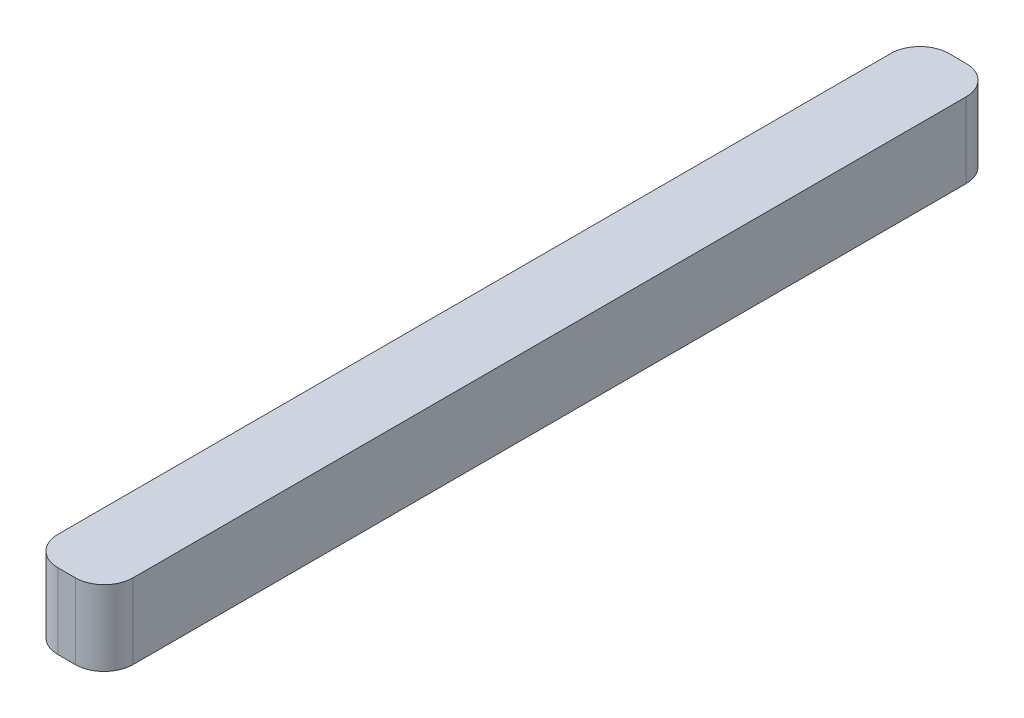
ISO-10303-21;
HEADER;
FILE_DESCRIPTION(('STEP AP214'),'2;1');
FILE_NAME('part.step','',(''),(''),'','','');
FILE_SCHEMA(('AUTOMOTIVE_DESIGN { 1 0 10303 214 1 1 1 1 }'));
ENDSEC;
DATA;
#1=APPLICATION_CONTEXT('core data for automotive mechanical design processes');
#2=APPLICATION_PROTOCOL_DEFINITION('international standard','automotive_design',2000,#1);
#3=PRODUCT_CONTEXT('',#1,'mechanical');
#4=PRODUCT('Part','Part','',(#3));
#5=PRODUCT_RELATED_PRODUCT_CATEGORY('part','',(#4));
#6=PRODUCT_DEFINITION_FORMATION('','',#4);
#7=PRODUCT_DEFINITION_CONTEXT('part definition',#1,'design');
#8=PRODUCT_DEFINITION('design','',#6,#7);
#9=PRODUCT_DEFINITION_SHAPE('','',#8);
#10=(LENGTH_UNIT() NAMED_UNIT(*) SI_UNIT(.MILLI.,.METRE.));
#11=(NAMED_UNIT(*) PLANE_ANGLE_UNIT() SI_UNIT($,.RADIAN.));
#12=(NAMED_UNIT(*) SI_UNIT($,.STERADIAN.) SOLID_ANGLE_UNIT());
#13=UNCERTAINTY_MEASURE_WITH_UNIT(LENGTH_MEASURE(1.E-05),#10,'distance_accuracy_value','');
#14=(GEOMETRIC_REPRESENTATION_CONTEXT(3) GLOBAL_UNCERTAINTY_ASSIGNED_CONTEXT((#13)) GLOBAL_UNIT_ASSIGNED_CONTEXT((#10,
#11,#12)) REPRESENTATION_CONTEXT('',''));
#15=CARTESIAN_POINT('',(0.,0.,0.));
#16=DIRECTION('',(0.,0.,1.));
#17=DIRECTION('',(1.,0.,0.));
#18=AXIS2_PLACEMENT_3D('',#15,#16,#17);
#19=CARTESIAN_POINT('',(8.8,2.6,-6.8));
#20=DIRECTION('',(0.,-1.,0.));
#21=DIRECTION('',(0.,0.,-1.));
#22=AXIS2_PLACEMENT_3D('',#19,#20,#21);
#23=CYLINDRICAL_SURFACE('',#22,1.);
#24=CARTESIAN_POINT('',(8.8,0.,-6.8));
#25=DIRECTION('',(0.,-1.,0.));
#26=DIRECTION('',(0.,0.,-1.));
#27=AXIS2_PLACEMENT_3D('',#24,#25,#26);
#28=CIRCLE('',#27,1.);
#29=CARTESIAN_POINT('',(8.8,0.,-7.8));
#30=VERTEX_POINT('',#29);
#31=CARTESIAN_POINT('',(7.8,0.,-6.8));
#32=VERTEX_POINT('',#31);
#33=EDGE_CURVE('E122',#30,#32,#28,.F.);
#34=ORIENTED_EDGE('',*,*,#33,.T.);
#35=DIRECTION('',(0.,-1.,0.));
#36=VECTOR('',#35,1.);
#37=CARTESIAN_POINT('',(7.8,1.3,-6.8));
#38=LINE('',#37,#36);
#39=CARTESIAN_POINT('',(7.8,2.6,-6.8));
#40=VERTEX_POINT('',#39);
#41=EDGE_CURVE('E113',#40,#32,#38,.T.);
#42=ORIENTED_EDGE('',*,*,#41,.F.);
#43=CARTESIAN_POINT('',(8.8,2.6,-6.8));
#44=DIRECTION('',(0.,-1.,0.));
#45=DIRECTION('',(0.,0.,-1.));
#46=AXIS2_PLACEMENT_3D('',#43,#44,#45);
#47=CIRCLE('',#46,1.);
#48=CARTESIAN_POINT('',(8.8,2.6,-7.8));
#49=VERTEX_POINT('',#48);
#50=EDGE_CURVE('E20',#40,#49,#47,.T.);
#51=ORIENTED_EDGE('',*,*,#50,.T.);
#52=DIRECTION('',(0.,1.,0.));
#53=VECTOR('',#52,1.);
#54=CARTESIAN_POINT('',(8.8,1.3,-7.8));
#55=LINE('',#54,#53);
#56=EDGE_CURVE('E121',#30,#49,#55,.T.);
#57=ORIENTED_EDGE('',*,*,#56,.F.);
#58=EDGE_LOOP('',(#34,#42,#51,#57));
#59=FACE_BOUND('',#58,.T.);
#60=ADVANCED_FACE('F16',(#59),#23,.T.);
#61=CARTESIAN_POINT('',(9.41,-0.01,-7.8));
#62=DIRECTION('',(0.,0.,-1.));
#63=DIRECTION('',(-1.,0.,0.));
#64=AXIS2_PLACEMENT_3D('',#61,#62,#63);
#65=PLANE('',#64);
#66=ORIENTED_EDGE('',*,*,#56,.T.);
#67=DIRECTION('',(1.,0.,0.));
#68=VECTOR('',#67,1.);
#69=CARTESIAN_POINT('',(9.1,2.6,-7.8));
#70=LINE('',#69,#68);
#71=CARTESIAN_POINT('',(9.4,2.6,-7.8));
#72=VERTEX_POINT('',#71);
#73=EDGE_CURVE('E65',#49,#72,#70,.T.);
#74=ORIENTED_EDGE('',*,*,#73,.T.);
#75=DIRECTION('',(0.,1.,0.));
#76=VECTOR('',#75,1.);
#77=CARTESIAN_POINT('',(9.4,1.3,-7.8));
#78=LINE('',#77,#76);
#79=CARTESIAN_POINT('',(9.4,0.,-7.8));
#80=VERTEX_POINT('',#79);
#81=EDGE_CURVE('E116',#80,#72,#78,.T.);
#82=ORIENTED_EDGE('',*,*,#81,.F.);
#83=DIRECTION('',(1.,0.,0.));
#84=VECTOR('',#83,1.);
#85=CARTESIAN_POINT('',(9.1,0.,-7.8));
#86=LINE('',#85,#84);
#87=EDGE_CURVE('E130',#30,#80,#86,.T.);
#88=ORIENTED_EDGE('',*,*,#87,.F.);
#89=EDGE_LOOP('',(#66,#74,#82,#88));
#90=FACE_BOUND('',#89,.T.);
#91=ADVANCED_FACE('F138',(#90),#65,.T.);
#92=CARTESIAN_POINT('',(7.8,-0.01,-6.81));
#93=DIRECTION('',(-1.,0.,0.));
#94=DIRECTION('',(0.,0.,1.));
#95=AXIS2_PLACEMENT_3D('',#92,#93,#94);
#96=PLANE('',#95);
#97=ORIENTED_EDGE('',*,*,#41,.T.);
#98=DIRECTION('',(0.,0.,-1.));
#99=VECTOR('',#98,1.);
#100=CARTESIAN_POINT('',(7.8,0.,7.6));
#101=LINE('',#100,#99);
#102=CARTESIAN_POINT('',(7.8,0.,22.));
#103=VERTEX_POINT('',#102);
#104=EDGE_CURVE('E132',#103,#32,#101,.T.);
#105=ORIENTED_EDGE('',*,*,#104,.F.);
#106=DIRECTION('',(0.,-1.,0.));
#107=VECTOR('',#106,1.);
#108=CARTESIAN_POINT('',(7.8,1.3,22.));
#109=LINE('',#108,#107);
#110=CARTESIAN_POINT('',(7.8,2.6,22.));
#111=VERTEX_POINT('',#110);
#112=EDGE_CURVE('E111',#111,#103,#109,.T.);
#113=ORIENTED_EDGE('',*,*,#112,.F.);
#114=DIRECTION('',(0.,0.,1.));
#115=VECTOR('',#114,1.);
#116=CARTESIAN_POINT('',(7.8,2.6,7.6));
#117=LINE('',#116,#115);
#118=EDGE_CURVE('E97',#40,#111,#117,.T.);
#119=ORIENTED_EDGE('',*,*,#118,.F.);
#120=EDGE_LOOP('',(#97,#105,#113,#119));
#121=FACE_BOUND('',#120,.T.);
#122=ADVANCED_FACE('F176',(#121),#96,.T.);
#123=CARTESIAN_POINT('',(8.8,0.,22.));
#124=DIRECTION('',(0.,1.,0.));
#125=DIRECTION('',(0.,0.,1.));
#126=AXIS2_PLACEMENT_3D('',#123,#124,#125);
#127=CYLINDRICAL_SURFACE('',#126,1.);
#128=CARTESIAN_POINT('',(8.8,2.6,22.));
#129=DIRECTION('',(0.,1.,0.));
#130=DIRECTION('',(0.,0.,1.));
#131=AXIS2_PLACEMENT_3D('',#128,#129,#130);
#132=CIRCLE('',#131,1.);
#133=CARTESIAN_POINT('',(8.8,2.6,23.));
#134=VERTEX_POINT('',#133);
#135=EDGE_CURVE('E91',#111,#134,#132,.T.);
#136=ORIENTED_EDGE('',*,*,#135,.F.);
#137=ORIENTED_EDGE('',*,*,#112,.T.);
#138=CARTESIAN_POINT('',(8.8,0.,22.));
#139=DIRECTION('',(0.,1.,0.));
#140=DIRECTION('',(0.,0.,1.));
#141=AXIS2_PLACEMENT_3D('',#138,#139,#140);
#142=CIRCLE('',#141,1.);
#143=CARTESIAN_POINT('',(8.8,0.,23.));
#144=VERTEX_POINT('',#143);
#145=EDGE_CURVE('E86',#144,#103,#142,.F.);
#146=ORIENTED_EDGE('',*,*,#145,.F.);
#147=DIRECTION('',(0.,-1.,0.));
#148=VECTOR('',#147,1.);
#149=CARTESIAN_POINT('',(8.8,1.3,23.));
#150=LINE('',#149,#148);
#151=EDGE_CURVE('E100',#134,#144,#150,.T.);
#152=ORIENTED_EDGE('',*,*,#151,.F.);
#153=EDGE_LOOP('',(#136,#137,#146,#152));
#154=FACE_BOUND('',#153,.T.);
#155=ADVANCED_FACE('F101',(#154),#127,.T.);
#156=CARTESIAN_POINT('',(10.41,0.,23.01));
#157=DIRECTION('',(0.,-1.,0.));
#158=DIRECTION('',(-1.,0.,0.));
#159=AXIS2_PLACEMENT_3D('',#156,#157,#158);
#160=PLANE('',#159);
#161=CARTESIAN_POINT('',(9.4,0.,-6.8));
#162=DIRECTION('',(0.,-1.,0.));
#163=DIRECTION('',(0.,0.,-1.));
#164=AXIS2_PLACEMENT_3D('',#161,#162,#163);
#165=CIRCLE('',#164,1.);
#166=CARTESIAN_POINT('',(10.4,0.,-6.8));
#167=VERTEX_POINT('',#166);
#168=EDGE_CURVE('E119',#167,#80,#165,.F.);
#169=ORIENTED_EDGE('',*,*,#168,.F.);
#170=DIRECTION('',(0.,0.,-1.));
#171=VECTOR('',#170,1.);
#172=CARTESIAN_POINT('',(10.4,0.,7.6));
#173=LINE('',#172,#171);
#174=CARTESIAN_POINT('',(10.4,0.,22.));
#175=VERTEX_POINT('',#174);
#176=EDGE_CURVE('E144',#175,#167,#173,.T.);
#177=ORIENTED_EDGE('',*,*,#176,.F.);
#178=CARTESIAN_POINT('',(9.4,0.,22.));
#179=DIRECTION('',(0.,-1.,0.));
#180=DIRECTION('',(0.,0.,-1.));
#181=AXIS2_PLACEMENT_3D('',#178,#179,#180);
#182=CIRCLE('',#181,1.);
#183=CARTESIAN_POINT('',(9.4,0.,23.));
#184=VERTEX_POINT('',#183);
#185=EDGE_CURVE('E34',#175,#184,#182,.T.);
#186=ORIENTED_EDGE('',*,*,#185,.T.);
#187=DIRECTION('',(1.,0.,0.));
#188=VECTOR('',#187,1.);
#189=CARTESIAN_POINT('',(9.1,0.,23.));
#190=LINE('',#189,#188);
#191=EDGE_CURVE('E104',#144,#184,#190,.T.);
#192=ORIENTED_EDGE('',*,*,#191,.F.);
#193=ORIENTED_EDGE('',*,*,#145,.T.);
#194=ORIENTED_EDGE('',*,*,#104,.T.);
#195=ORIENTED_EDGE('',*,*,#33,.F.);
#196=ORIENTED_EDGE('',*,*,#87,.T.);
#197=EDGE_LOOP('',(#169,#177,#186,#192,#193,#194,#195,#196));
#198=FACE_BOUND('',#197,.T.);
#199=ADVANCED_FACE('F158',(#198),#160,.T.);
#200=CARTESIAN_POINT('',(9.4,2.6,-6.8));
#201=DIRECTION('',(0.,-1.,0.));
#202=DIRECTION('',(0.,0.,-1.));
#203=AXIS2_PLACEMENT_3D('',#200,#201,#202);
#204=CYLINDRICAL_SURFACE('',#203,1.);
#205=ORIENTED_EDGE('',*,*,#168,.T.);
#206=ORIENTED_EDGE('',*,*,#81,.T.);
#207=CARTESIAN_POINT('',(9.4,2.6,-6.8));
#208=DIRECTION('',(0.,-1.,0.));
#209=DIRECTION('',(0.,0.,-1.));
#210=AXIS2_PLACEMENT_3D('',#207,#208,#209);
#211=CIRCLE('',#210,1.);
#212=CARTESIAN_POINT('',(10.4,2.6,-6.8));
#213=VERTEX_POINT('',#212);
#214=EDGE_CURVE('E124',#213,#72,#211,.F.);
#215=ORIENTED_EDGE('',*,*,#214,.F.);
#216=DIRECTION('',(0.,1.,0.));
#217=VECTOR('',#216,1.);
#218=CARTESIAN_POINT('',(10.4,1.3,-6.8));
#219=LINE('',#218,#217);
#220=EDGE_CURVE('E146',#167,#213,#219,.T.);
#221=ORIENTED_EDGE('',*,*,#220,.F.);
#222=EDGE_LOOP('',(#205,#206,#215,#221));
#223=FACE_BOUND('',#222,.T.);
#224=ADVANCED_FACE('F157',(#223),#204,.T.);
#225=CARTESIAN_POINT('',(7.79,2.6,-7.81));
#226=DIRECTION('',(0.,1.,0.));
#227=DIRECTION('',(0.,0.,1.));
#228=AXIS2_PLACEMENT_3D('',#225,#226,#227);
#229=PLANE('',#228);
#230=ORIENTED_EDGE('',*,*,#135,.T.);
#231=DIRECTION('',(-1.,0.,0.));
#232=VECTOR('',#231,1.);
#233=CARTESIAN_POINT('',(9.1,2.6,23.));
#234=LINE('',#233,#232);
#235=CARTESIAN_POINT('',(9.4,2.6,23.));
#236=VERTEX_POINT('',#235);
#237=EDGE_CURVE('E94',#236,#134,#234,.T.);
#238=ORIENTED_EDGE('',*,*,#237,.F.);
#239=CARTESIAN_POINT('',(9.4,2.6,22.));
#240=DIRECTION('',(0.,-1.,0.));
#241=DIRECTION('',(0.,0.,-1.));
#242=AXIS2_PLACEMENT_3D('',#239,#240,#241);
#243=CIRCLE('',#242,1.);
#244=CARTESIAN_POINT('',(10.4,2.6,22.));
#245=VERTEX_POINT('',#244);
#246=EDGE_CURVE('E118',#236,#245,#243,.F.);
#247=ORIENTED_EDGE('',*,*,#246,.T.);
#248=DIRECTION('',(0.,0.,1.));
#249=VECTOR('',#248,1.);
#250=CARTESIAN_POINT('',(10.4,2.6,7.6));
#251=LINE('',#250,#249);
#252=EDGE_CURVE('E150',#213,#245,#251,.T.);
#253=ORIENTED_EDGE('',*,*,#252,.F.);
#254=ORIENTED_EDGE('',*,*,#214,.T.);
#255=ORIENTED_EDGE('',*,*,#73,.F.);
#256=ORIENTED_EDGE('',*,*,#50,.F.);
#257=ORIENTED_EDGE('',*,*,#118,.T.);
#258=EDGE_LOOP('',(#230,#238,#247,#253,#254,#255,#256,#257));
#259=FACE_BOUND('',#258,.T.);
#260=ADVANCED_FACE('F92',(#259),#229,.T.);
#261=CARTESIAN_POINT('',(8.79,-0.01,23.));
#262=DIRECTION('',(0.,0.,1.));
#263=DIRECTION('',(1.,0.,0.));
#264=AXIS2_PLACEMENT_3D('',#261,#262,#263);
#265=PLANE('',#264);
#266=ORIENTED_EDGE('',*,*,#151,.T.);
#267=ORIENTED_EDGE('',*,*,#191,.T.);
#268=DIRECTION('',(0.,-1.,0.));
#269=VECTOR('',#268,1.);
#270=CARTESIAN_POINT('',(9.4,1.3,23.));
#271=LINE('',#270,#269);
#272=EDGE_CURVE('E26',#236,#184,#271,.T.);
#273=ORIENTED_EDGE('',*,*,#272,.F.);
#274=ORIENTED_EDGE('',*,*,#237,.T.);
#275=EDGE_LOOP('',(#266,#267,#273,#274));
#276=FACE_BOUND('',#275,.T.);
#277=ADVANCED_FACE('F106',(#276),#265,.T.);
#278=CARTESIAN_POINT('',(10.4,-0.01,22.01));
#279=DIRECTION('',(1.,0.,0.));
#280=DIRECTION('',(0.,0.,-1.));
#281=AXIS2_PLACEMENT_3D('',#278,#279,#280);
#282=PLANE('',#281);
#283=ORIENTED_EDGE('',*,*,#220,.T.);
#284=ORIENTED_EDGE('',*,*,#252,.T.);
#285=DIRECTION('',(0.,1.,0.));
#286=VECTOR('',#285,1.);
#287=CARTESIAN_POINT('',(10.4,1.3,22.));
#288=LINE('',#287,#286);
#289=EDGE_CURVE('E11',#175,#245,#288,.T.);
#290=ORIENTED_EDGE('',*,*,#289,.F.);
#291=ORIENTED_EDGE('',*,*,#176,.T.);
#292=EDGE_LOOP('',(#283,#284,#290,#291));
#293=FACE_BOUND('',#292,.T.);
#294=ADVANCED_FACE('F159',(#293),#282,.T.);
#295=CARTESIAN_POINT('',(9.4,2.6,22.));
#296=DIRECTION('',(0.,-1.,0.));
#297=DIRECTION('',(0.,0.,-1.));
#298=AXIS2_PLACEMENT_3D('',#295,#296,#297);
#299=CYLINDRICAL_SURFACE('',#298,1.);
#300=ORIENTED_EDGE('',*,*,#185,.F.);
#301=ORIENTED_EDGE('',*,*,#289,.T.);
#302=ORIENTED_EDGE('',*,*,#246,.F.);
#303=ORIENTED_EDGE('',*,*,#272,.T.);
#304=EDGE_LOOP('',(#300,#301,#302,#303));
#305=FACE_BOUND('',#304,.T.);
#306=ADVANCED_FACE('F18',(#305),#299,.T.);
#307=CLOSED_SHELL('',(#60,#91,#122,#155,#199,#224,#260,#277,#294,#306));
#308=MANIFOLD_SOLID_BREP('B1',#307);
#309=ADVANCED_BREP_SHAPE_REPRESENTATION('',(#18,#308),#14);
#310=SHAPE_DEFINITION_REPRESENTATION(#9,#309);
ENDSEC;
END-ISO-10303-21;
